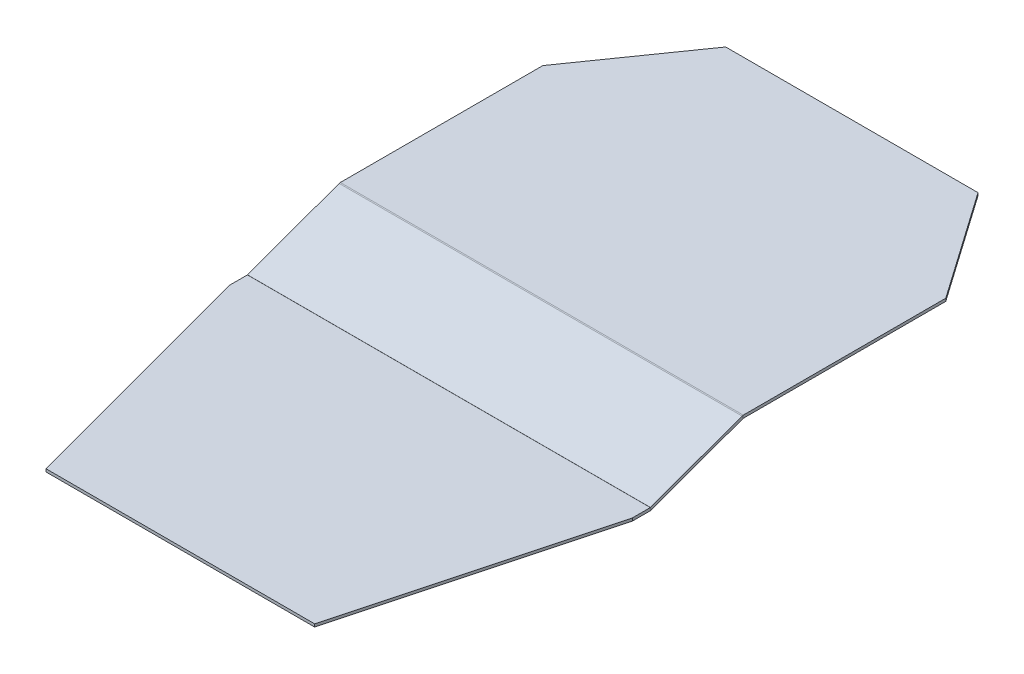
ISO-10303-21;
HEADER;
FILE_DESCRIPTION(('STEP AP214'),'2;1');
FILE_NAME('part.step','',(''),(''),'','','');
FILE_SCHEMA(('AUTOMOTIVE_DESIGN { 1 0 10303 214 1 1 1 1 }'));
ENDSEC;
DATA;
#1=APPLICATION_CONTEXT('core data for automotive mechanical design processes');
#2=APPLICATION_PROTOCOL_DEFINITION('international standard','automotive_design',2000,#1);
#3=PRODUCT_CONTEXT('',#1,'mechanical');
#4=PRODUCT('Part','Part','',(#3));
#5=PRODUCT_RELATED_PRODUCT_CATEGORY('part','',(#4));
#6=PRODUCT_DEFINITION_FORMATION('','',#4);
#7=PRODUCT_DEFINITION_CONTEXT('part definition',#1,'design');
#8=PRODUCT_DEFINITION('design','',#6,#7);
#9=PRODUCT_DEFINITION_SHAPE('','',#8);
#10=(LENGTH_UNIT() NAMED_UNIT(*) SI_UNIT(.MILLI.,.METRE.));
#11=(NAMED_UNIT(*) PLANE_ANGLE_UNIT() SI_UNIT($,.RADIAN.));
#12=(NAMED_UNIT(*) SI_UNIT($,.STERADIAN.) SOLID_ANGLE_UNIT());
#13=UNCERTAINTY_MEASURE_WITH_UNIT(LENGTH_MEASURE(1.E-05),#10,'distance_accuracy_value','');
#14=(GEOMETRIC_REPRESENTATION_CONTEXT(3) GLOBAL_UNCERTAINTY_ASSIGNED_CONTEXT((#13)) GLOBAL_UNIT_ASSIGNED_CONTEXT((#10,
#11,#12)) REPRESENTATION_CONTEXT('',''));
#15=CARTESIAN_POINT('',(0.,0.,0.));
#16=DIRECTION('',(0.,0.,1.));
#17=DIRECTION('',(1.,0.,0.));
#18=AXIS2_PLACEMENT_3D('',#15,#16,#17);
#19=CARTESIAN_POINT('',(457.2,0.0444224155289619,-0.122049583583453));
#20=DIRECTION('',(1.,0.,0.));
#21=DIRECTION('',(0.,0.,-1.));
#22=AXIS2_PLACEMENT_3D('',#19,#20,#21);
#23=PLANE('',#22);
#24=DIRECTION('',(0.,-0.939692620785908,-0.342020143325669));
#25=VECTOR('',#24,1.);
#26=CARTESIAN_POINT('',(457.2,0.0444224155289619,-0.122049583583453));
#27=LINE('',#26,#25);
#28=CARTESIAN_POINT('',(457.2,0.0444224155289619,-0.122049583583453));
#29=VERTEX_POINT('',#28);
#30=CARTESIAN_POINT('',(457.2,-2.9391016554663,-1.20796353864245));
#31=VERTEX_POINT('',#30);
#32=EDGE_CURVE('E44',#29,#31,#27,.T.);
#33=ORIENTED_EDGE('',*,*,#32,.F.);
#34=CARTESIAN_POINT('',(457.2,0.736599999999936,0.129882453990262));
#35=DIRECTION('',(-1.,0.,0.));
#36=DIRECTION('',(0.,0.,1.));
#37=AXIS2_PLACEMENT_3D('',#34,#35,#36);
#38=CIRCLE('',#37,0.7366);
#39=CARTESIAN_POINT('',(457.2,0.,0.129882453990482));
#40=VERTEX_POINT('',#39);
#41=EDGE_CURVE('E299',#40,#29,#38,.F.);
#42=ORIENTED_EDGE('',*,*,#41,.F.);
#43=DIRECTION('',(0.,1.,-2.9869343000726E-13));
#44=VECTOR('',#43,1.);
#45=CARTESIAN_POINT('',(457.2,-3.17500000000006,0.12988245399143));
#46=LINE('',#45,#44);
#47=CARTESIAN_POINT('',(457.2,-3.17500000000006,0.12988245399143));
#48=VERTEX_POINT('',#47);
#49=EDGE_CURVE('E192',#48,#40,#46,.T.);
#50=ORIENTED_EDGE('',*,*,#49,.F.);
#51=CARTESIAN_POINT('',(457.2,0.736599999999936,0.129882453990262));
#52=DIRECTION('',(1.,0.,0.));
#53=DIRECTION('',(0.,0.,-1.));
#54=AXIS2_PLACEMENT_3D('',#51,#52,#53);
#55=CIRCLE('',#54,3.9116);
#56=EDGE_CURVE('E210',#48,#31,#55,.T.);
#57=ORIENTED_EDGE('',*,*,#56,.T.);
#58=EDGE_LOOP('',(#33,#42,#50,#57));
#59=FACE_BOUND('',#58,.T.);
#60=ADVANCED_FACE('F37',(#59),#23,.T.);
#61=CARTESIAN_POINT('',(457.2,-3.17500000000006,0.12988245399143));
#62=DIRECTION('',(1.,0.,0.));
#63=DIRECTION('',(0.,0.,-1.));
#64=AXIS2_PLACEMENT_3D('',#61,#62,#63);
#65=PLANE('',#64);
#66=DIRECTION('',(0.,0.342020143325669,-0.939692620785908));
#67=VECTOR('',#66,1.);
#68=CARTESIAN_POINT('',(457.2,0.,0.));
#69=LINE('',#68,#67);
#70=CARTESIAN_POINT('',(457.2,37.8641016554662,-104.030764306328));
#71=VERTEX_POINT('',#70);
#72=EDGE_CURVE('E203',#29,#71,#69,.T.);
#73=ORIENTED_EDGE('',*,*,#72,.F.);
#74=ORIENTED_EDGE('',*,*,#32,.T.);
#75=DIRECTION('',(0.,0.342020143325669,-0.939692620785908));
#76=VECTOR('',#75,1.);
#77=CARTESIAN_POINT('',(457.2,-2.98352407099526,-1.085913955059));
#78=LINE('',#77,#76);
#79=CARTESIAN_POINT('',(457.2,34.8805775844709,-105.116678261387));
#80=VERTEX_POINT('',#79);
#81=EDGE_CURVE('E200',#31,#80,#78,.T.);
#82=ORIENTED_EDGE('',*,*,#81,.T.);
#83=DIRECTION('',(0.,0.939692620785913,0.342020143325657));
#84=VECTOR('',#83,1.);
#85=CARTESIAN_POINT('',(457.2,34.8805775844709,-105.116678261387));
#86=LINE('',#85,#84);
#87=EDGE_CURVE('E183',#80,#71,#86,.T.);
#88=ORIENTED_EDGE('',*,*,#87,.T.);
#89=EDGE_LOOP('',(#73,#74,#82,#88));
#90=FACE_BOUND('',#89,.T.);
#91=ADVANCED_FACE('F198',(#90),#65,.T.);
#92=CARTESIAN_POINT('',(0.,0.,0.129882453990482));
#93=DIRECTION('',(-1.,0.,0.));
#94=DIRECTION('',(0.,0.,1.));
#95=AXIS2_PLACEMENT_3D('',#92,#93,#94);
#96=PLANE('',#95);
#97=DIRECTION('',(0.,-1.,2.9869343000726E-13));
#98=VECTOR('',#97,1.);
#99=CARTESIAN_POINT('',(0.,0.,0.129882453990482));
#100=LINE('',#99,#98);
#101=CARTESIAN_POINT('',(0.,0.,0.129882453990482));
#102=VERTEX_POINT('',#101);
#103=CARTESIAN_POINT('',(0.,-3.17500000000006,0.12988245399143));
#104=VERTEX_POINT('',#103);
#105=EDGE_CURVE('E189',#102,#104,#100,.T.);
#106=ORIENTED_EDGE('',*,*,#105,.F.);
#107=CARTESIAN_POINT('',(0.,0.736599999999936,0.129882453990262));
#108=DIRECTION('',(-1.,0.,0.));
#109=DIRECTION('',(0.,0.,1.));
#110=AXIS2_PLACEMENT_3D('',#107,#108,#109);
#111=CIRCLE('',#110,0.7366);
#112=CARTESIAN_POINT('',(0.,0.0444224155289619,-0.122049583583453));
#113=VERTEX_POINT('',#112);
#114=EDGE_CURVE('E251',#102,#113,#111,.F.);
#115=ORIENTED_EDGE('',*,*,#114,.T.);
#116=DIRECTION('',(0.,0.939692620785908,0.342020143325669));
#117=VECTOR('',#116,1.);
#118=CARTESIAN_POINT('',(0.,-2.9391016554663,-1.20796353864245));
#119=LINE('',#118,#117);
#120=CARTESIAN_POINT('',(0.,-2.9391016554663,-1.20796353864245));
#121=VERTEX_POINT('',#120);
#122=EDGE_CURVE('E187',#121,#113,#119,.T.);
#123=ORIENTED_EDGE('',*,*,#122,.F.);
#124=CARTESIAN_POINT('',(0.,0.736599999999936,0.129882453990262));
#125=DIRECTION('',(1.,0.,0.));
#126=DIRECTION('',(0.,0.,-1.));
#127=AXIS2_PLACEMENT_3D('',#124,#125,#126);
#128=CIRCLE('',#127,3.9116);
#129=EDGE_CURVE('E222',#104,#121,#128,.T.);
#130=ORIENTED_EDGE('',*,*,#129,.F.);
#131=EDGE_LOOP('',(#106,#115,#123,#130));
#132=FACE_BOUND('',#131,.T.);
#133=ADVANCED_FACE('F319',(#132),#96,.T.);
#134=CARTESIAN_POINT('',(0.,-2.9391016554663,-1.20796353864245));
#135=DIRECTION('',(-1.,0.,0.));
#136=DIRECTION('',(0.,0.,1.));
#137=AXIS2_PLACEMENT_3D('',#134,#135,#136);
#138=PLANE('',#137);
#139=DIRECTION('',(0.,1.,0.));
#140=VECTOR('',#139,1.);
#141=CARTESIAN_POINT('',(0.,-3.17500000000006,20.4177284632565));
#142=LINE('',#141,#140);
#143=CARTESIAN_POINT('',(0.,-3.175,20.4177284632566));
#144=VERTEX_POINT('',#143);
#145=CARTESIAN_POINT('',(0.,0.,20.4177284632565));
#146=VERTEX_POINT('',#145);
#147=EDGE_CURVE('E59',#144,#146,#142,.T.);
#148=ORIENTED_EDGE('',*,*,#147,.T.);
#149=DIRECTION('',(0.,0.,-1.));
#150=VECTOR('',#149,1.);
#151=CARTESIAN_POINT('',(0.,0.,304.8));
#152=LINE('',#151,#150);
#153=EDGE_CURVE('E254',#146,#102,#152,.T.);
#154=ORIENTED_EDGE('',*,*,#153,.T.);
#155=ORIENTED_EDGE('',*,*,#105,.T.);
#156=DIRECTION('',(0.,0.,-1.));
#157=VECTOR('',#156,1.);
#158=CARTESIAN_POINT('',(0.,-3.175,304.8));
#159=LINE('',#158,#157);
#160=EDGE_CURVE('E256',#144,#104,#159,.T.);
#161=ORIENTED_EDGE('',*,*,#160,.F.);
#162=EDGE_LOOP('',(#148,#154,#155,#161));
#163=FACE_BOUND('',#162,.T.);
#164=ADVANCED_FACE('F383',(#163),#138,.T.);
#165=CARTESIAN_POINT('',(457.2,38.1,-105.36861029896));
#166=DIRECTION('',(1.,0.,0.));
#167=DIRECTION('',(0.,0.,-1.));
#168=AXIS2_PLACEMENT_3D('',#165,#166,#167);
#169=PLANE('',#168);
#170=DIRECTION('',(0.,-1.,0.));
#171=VECTOR('',#170,1.);
#172=CARTESIAN_POINT('',(457.2,38.1,-105.36861029896));
#173=LINE('',#172,#171);
#174=CARTESIAN_POINT('',(457.2,38.1,-105.36861029896));
#175=VERTEX_POINT('',#174);
#176=CARTESIAN_POINT('',(457.2,34.925,-105.36861029896));
#177=VERTEX_POINT('',#176);
#178=EDGE_CURVE('E185',#175,#177,#173,.T.);
#179=ORIENTED_EDGE('',*,*,#178,.F.);
#180=CARTESIAN_POINT('',(457.2,34.1884,-105.36861029896));
#181=DIRECTION('',(1.,0.,0.));
#182=DIRECTION('',(0.,0.,-1.));
#183=AXIS2_PLACEMENT_3D('',#180,#181,#182);
#184=CIRCLE('',#183,3.9116);
#185=EDGE_CURVE('E303',#71,#175,#184,.F.);
#186=ORIENTED_EDGE('',*,*,#185,.F.);
#187=ORIENTED_EDGE('',*,*,#87,.F.);
#188=CARTESIAN_POINT('',(457.2,34.1884,-105.36861029896));
#189=DIRECTION('',(1.,0.,0.));
#190=DIRECTION('',(0.,0.,-1.));
#191=AXIS2_PLACEMENT_3D('',#188,#189,#190);
#192=CIRCLE('',#191,0.7366);
#193=EDGE_CURVE('E232',#80,#177,#192,.F.);
#194=ORIENTED_EDGE('',*,*,#193,.T.);
#195=EDGE_LOOP('',(#179,#186,#187,#194));
#196=FACE_BOUND('',#195,.T.);
#197=ADVANCED_FACE('F343',(#196),#169,.T.);
#198=CARTESIAN_POINT('',(457.2,34.8805775844709,-105.116678261387));
#199=DIRECTION('',(1.,0.,0.));
#200=DIRECTION('',(0.,0.,-1.));
#201=AXIS2_PLACEMENT_3D('',#198,#199,#200);
#202=PLANE('',#201);
#203=DIRECTION('',(0.,1.,0.));
#204=VECTOR('',#203,1.);
#205=CARTESIAN_POINT('',(457.2,-3.17500000000006,-335.182271536743));
#206=LINE('',#205,#204);
#207=CARTESIAN_POINT('',(457.2,34.925,-335.182271536743));
#208=VERTEX_POINT('',#207);
#209=CARTESIAN_POINT('',(457.2,38.1,-335.182271536743));
#210=VERTEX_POINT('',#209);
#211=EDGE_CURVE('E157',#208,#210,#206,.T.);
#212=ORIENTED_EDGE('',*,*,#211,.T.);
#213=DIRECTION('',(0.,0.,-1.));
#214=VECTOR('',#213,1.);
#215=CARTESIAN_POINT('',(457.2,38.1,-104.678889681221));
#216=LINE('',#215,#214);
#217=EDGE_CURVE('E341',#175,#210,#216,.T.);
#218=ORIENTED_EDGE('',*,*,#217,.F.);
#219=ORIENTED_EDGE('',*,*,#178,.T.);
#220=DIRECTION('',(0.,0.,-1.));
#221=VECTOR('',#220,1.);
#222=CARTESIAN_POINT('',(457.2,34.925,-104.678889681221));
#223=LINE('',#222,#221);
#224=EDGE_CURVE('E264',#177,#208,#223,.T.);
#225=ORIENTED_EDGE('',*,*,#224,.T.);
#226=EDGE_LOOP('',(#212,#218,#219,#225));
#227=FACE_BOUND('',#226,.T.);
#228=ADVANCED_FACE('F348',(#227),#202,.T.);
#229=CARTESIAN_POINT('',(0.,37.8641016554662,-104.030764306328));
#230=DIRECTION('',(-1.,0.,0.));
#231=DIRECTION('',(0.,0.,1.));
#232=AXIS2_PLACEMENT_3D('',#229,#230,#231);
#233=PLANE('',#232);
#234=DIRECTION('',(0.,-0.939692620785913,-0.342020143325657));
#235=VECTOR('',#234,1.);
#236=CARTESIAN_POINT('',(0.,37.8641016554662,-104.030764306328));
#237=LINE('',#236,#235);
#238=CARTESIAN_POINT('',(0.,37.8641016554662,-104.030764306328));
#239=VERTEX_POINT('',#238);
#240=CARTESIAN_POINT('',(0.,34.8805775844709,-105.116678261387));
#241=VERTEX_POINT('',#240);
#242=EDGE_CURVE('E181',#239,#241,#237,.T.);
#243=ORIENTED_EDGE('',*,*,#242,.F.);
#244=CARTESIAN_POINT('',(0.,34.1884,-105.36861029896));
#245=DIRECTION('',(1.,0.,0.));
#246=DIRECTION('',(0.,0.,-1.));
#247=AXIS2_PLACEMENT_3D('',#244,#245,#246);
#248=CIRCLE('',#247,3.9116);
#249=CARTESIAN_POINT('',(0.,38.1,-105.36861029896));
#250=VERTEX_POINT('',#249);
#251=EDGE_CURVE('E245',#239,#250,#248,.F.);
#252=ORIENTED_EDGE('',*,*,#251,.T.);
#253=DIRECTION('',(0.,1.,0.));
#254=VECTOR('',#253,1.);
#255=CARTESIAN_POINT('',(0.,34.925,-105.36861029896));
#256=LINE('',#255,#254);
#257=CARTESIAN_POINT('',(0.,34.925,-105.36861029896));
#258=VERTEX_POINT('',#257);
#259=EDGE_CURVE('E173',#258,#250,#256,.T.);
#260=ORIENTED_EDGE('',*,*,#259,.F.);
#261=CARTESIAN_POINT('',(0.,34.1884,-105.36861029896));
#262=DIRECTION('',(1.,0.,0.));
#263=DIRECTION('',(0.,0.,-1.));
#264=AXIS2_PLACEMENT_3D('',#261,#262,#263);
#265=CIRCLE('',#264,0.7366);
#266=EDGE_CURVE('E261',#241,#258,#265,.F.);
#267=ORIENTED_EDGE('',*,*,#266,.F.);
#268=EDGE_LOOP('',(#243,#252,#260,#267));
#269=FACE_BOUND('',#268,.T.);
#270=ADVANCED_FACE('F392',(#269),#233,.T.);
#271=CARTESIAN_POINT('',(0.,34.925,-105.36861029896));
#272=DIRECTION('',(-1.,0.,0.));
#273=DIRECTION('',(0.,0.,1.));
#274=AXIS2_PLACEMENT_3D('',#271,#272,#273);
#275=PLANE('',#274);
#276=DIRECTION('',(0.,0.342020143325669,-0.939692620785908));
#277=VECTOR('',#276,1.);
#278=CARTESIAN_POINT('',(0.,0.,0.));
#279=LINE('',#278,#277);
#280=EDGE_CURVE('E248',#113,#239,#279,.T.);
#281=ORIENTED_EDGE('',*,*,#280,.T.);
#282=ORIENTED_EDGE('',*,*,#242,.T.);
#283=DIRECTION('',(0.,0.342020143325669,-0.939692620785908));
#284=VECTOR('',#283,1.);
#285=CARTESIAN_POINT('',(0.,-2.98352407099526,-1.085913955059));
#286=LINE('',#285,#284);
#287=EDGE_CURVE('E259',#121,#241,#286,.T.);
#288=ORIENTED_EDGE('',*,*,#287,.F.);
#289=ORIENTED_EDGE('',*,*,#122,.T.);
#290=EDGE_LOOP('',(#281,#282,#288,#289));
#291=FACE_BOUND('',#290,.T.);
#292=ADVANCED_FACE('F293',(#291),#275,.T.);
#293=CARTESIAN_POINT('',(457.2,34.925,-104.678889681221));
#294=DIRECTION('',(0.,1.,0.));
#295=DIRECTION('',(0.,0.,1.));
#296=AXIS2_PLACEMENT_3D('',#293,#294,#295);
#297=PLANE('',#296);
#298=DIRECTION('',(-1.,0.,0.));
#299=VECTOR('',#298,1.);
#300=CARTESIAN_POINT('',(457.2,34.925,-457.2));
#301=LINE('',#300,#299);
#302=CARTESIAN_POINT('',(371.762266734803,34.925,-457.2));
#303=VERTEX_POINT('',#302);
#304=CARTESIAN_POINT('',(85.4377332651967,34.925,-457.2));
#305=VERTEX_POINT('',#304);
#306=EDGE_CURVE('E165',#303,#305,#301,.T.);
#307=ORIENTED_EDGE('',*,*,#306,.F.);
#308=DIRECTION('',(0.573576436351042,0.,0.819152044288995));
#309=VECTOR('',#308,1.);
#310=CARTESIAN_POINT('',(565.501163497915,34.925,-180.512180759342));
#311=LINE('',#310,#309);
#312=EDGE_CURVE('E243',#303,#208,#311,.T.);
#313=ORIENTED_EDGE('',*,*,#312,.T.);
#314=ORIENTED_EDGE('',*,*,#224,.F.);
#315=DIRECTION('',(-1.,0.,0.));
#316=VECTOR('',#315,1.);
#317=CARTESIAN_POINT('',(457.2,34.925,-105.36861029896));
#318=LINE('',#317,#316);
#319=EDGE_CURVE('E235',#177,#258,#318,.T.);
#320=ORIENTED_EDGE('',*,*,#319,.T.);
#321=DIRECTION('',(0.,0.,-1.));
#322=VECTOR('',#321,1.);
#323=CARTESIAN_POINT('',(0.,34.925,-104.678889681221));
#324=LINE('',#323,#322);
#325=CARTESIAN_POINT('',(0.,34.925,-335.182271536743));
#326=VERTEX_POINT('',#325);
#327=EDGE_CURVE('E239',#258,#326,#324,.T.);
#328=ORIENTED_EDGE('',*,*,#327,.T.);
#329=DIRECTION('',(0.573576436351041,0.,-0.819152044288995));
#330=VECTOR('',#329,1.);
#331=CARTESIAN_POINT('',(42.1130317378346,34.925,-395.325913871));
#332=LINE('',#331,#330);
#333=EDGE_CURVE('E331',#326,#305,#332,.T.);
#334=ORIENTED_EDGE('',*,*,#333,.T.);
#335=EDGE_LOOP('',(#307,#313,#314,#320,#328,#334));
#336=FACE_BOUND('',#335,.T.);
#337=ADVANCED_FACE('F397',(#336),#297,.F.);
#338=CARTESIAN_POINT('',(457.2,38.1,-457.2));
#339=DIRECTION('',(0.,0.,-1.));
#340=DIRECTION('',(-1.,0.,0.));
#341=AXIS2_PLACEMENT_3D('',#338,#339,#340);
#342=PLANE('',#341);
#343=DIRECTION('',(0.,1.,0.));
#344=VECTOR('',#343,1.);
#345=CARTESIAN_POINT('',(371.762266734803,-3.17500000000006,-457.2));
#346=LINE('',#345,#344);
#347=CARTESIAN_POINT('',(371.762266734803,38.1,-457.2));
#348=VERTEX_POINT('',#347);
#349=EDGE_CURVE('E51',#303,#348,#346,.T.);
#350=ORIENTED_EDGE('',*,*,#349,.F.);
#351=ORIENTED_EDGE('',*,*,#306,.T.);
#352=DIRECTION('',(0.,1.,0.));
#353=VECTOR('',#352,1.);
#354=CARTESIAN_POINT('',(85.4377332651967,-3.17500000000006,-457.2));
#355=LINE('',#354,#353);
#356=CARTESIAN_POINT('',(85.4377332651967,38.1,-457.2));
#357=VERTEX_POINT('',#356);
#358=EDGE_CURVE('E151',#305,#357,#355,.T.);
#359=ORIENTED_EDGE('',*,*,#358,.T.);
#360=DIRECTION('',(-1.,0.,0.));
#361=VECTOR('',#360,1.);
#362=CARTESIAN_POINT('',(457.2,38.1,-457.2));
#363=LINE('',#362,#361);
#364=EDGE_CURVE('E163',#348,#357,#363,.T.);
#365=ORIENTED_EDGE('',*,*,#364,.F.);
#366=EDGE_LOOP('',(#350,#351,#359,#365));
#367=FACE_BOUND('',#366,.T.);
#368=ADVANCED_FACE('F162',(#367),#342,.T.);
#369=CARTESIAN_POINT('',(457.2,38.1,-104.678889681221));
#370=DIRECTION('',(0.,1.,0.));
#371=DIRECTION('',(0.,0.,1.));
#372=AXIS2_PLACEMENT_3D('',#369,#370,#371);
#373=PLANE('',#372);
#374=DIRECTION('',(0.573576436351041,0.,0.819152044288995));
#375=VECTOR('',#374,1.);
#376=CARTESIAN_POINT('',(371.762266734803,38.1,-457.2));
#377=LINE('',#376,#375);
#378=EDGE_CURVE('E170',#348,#210,#377,.T.);
#379=ORIENTED_EDGE('',*,*,#378,.F.);
#380=ORIENTED_EDGE('',*,*,#364,.T.);
#381=DIRECTION('',(0.573576436351041,0.,-0.819152044288995));
#382=VECTOR('',#381,1.);
#383=CARTESIAN_POINT('',(85.4377332651967,38.1,-457.2));
#384=LINE('',#383,#382);
#385=CARTESIAN_POINT('',(0.,38.1,-335.182271536743));
#386=VERTEX_POINT('',#385);
#387=EDGE_CURVE('E148',#386,#357,#384,.T.);
#388=ORIENTED_EDGE('',*,*,#387,.F.);
#389=DIRECTION('',(0.,0.,-1.));
#390=VECTOR('',#389,1.);
#391=CARTESIAN_POINT('',(0.,38.1,-104.678889681221));
#392=LINE('',#391,#390);
#393=EDGE_CURVE('E242',#250,#386,#392,.T.);
#394=ORIENTED_EDGE('',*,*,#393,.F.);
#395=DIRECTION('',(-1.,0.,0.));
#396=VECTOR('',#395,1.);
#397=CARTESIAN_POINT('',(457.2,38.1,-105.36861029896));
#398=LINE('',#397,#396);
#399=EDGE_CURVE('E171',#175,#250,#398,.T.);
#400=ORIENTED_EDGE('',*,*,#399,.F.);
#401=ORIENTED_EDGE('',*,*,#217,.T.);
#402=EDGE_LOOP('',(#379,#380,#388,#394,#400,#401));
#403=FACE_BOUND('',#402,.T.);
#404=ADVANCED_FACE('F168',(#403),#373,.T.);
#405=CARTESIAN_POINT('',(457.2,34.1884,-105.36861029896));
#406=DIRECTION('',(-1.,0.,0.));
#407=DIRECTION('',(0.,0.,1.));
#408=AXIS2_PLACEMENT_3D('',#405,#406,#407);
#409=CYLINDRICAL_SURFACE('',#408,3.9116);
#410=ORIENTED_EDGE('',*,*,#251,.F.);
#411=DIRECTION('',(-1.,0.,0.));
#412=VECTOR('',#411,1.);
#413=CARTESIAN_POINT('',(457.2,37.8641016554662,-104.030764306328));
#414=LINE('',#413,#412);
#415=EDGE_CURVE('E176',#71,#239,#414,.T.);
#416=ORIENTED_EDGE('',*,*,#415,.F.);
#417=ORIENTED_EDGE('',*,*,#185,.T.);
#418=ORIENTED_EDGE('',*,*,#399,.T.);
#419=EDGE_LOOP('',(#410,#416,#417,#418));
#420=FACE_BOUND('',#419,.T.);
#421=ADVANCED_FACE('F289',(#420),#409,.T.);
#422=CARTESIAN_POINT('',(457.2,0.,0.));
#423=DIRECTION('',(0.,0.939692620785908,0.342020143325669));
#424=DIRECTION('',(0.,-0.342020143325669,0.939692620785908));
#425=AXIS2_PLACEMENT_3D('',#422,#423,#424);
#426=PLANE('',#425);
#427=ORIENTED_EDGE('',*,*,#280,.F.);
#428=DIRECTION('',(-1.,0.,0.));
#429=VECTOR('',#428,1.);
#430=CARTESIAN_POINT('',(457.2,0.0444224155289619,-0.122049583583453));
#431=LINE('',#430,#429);
#432=EDGE_CURVE('E278',#29,#113,#431,.T.);
#433=ORIENTED_EDGE('',*,*,#432,.F.);
#434=ORIENTED_EDGE('',*,*,#72,.T.);
#435=ORIENTED_EDGE('',*,*,#415,.T.);
#436=EDGE_LOOP('',(#427,#433,#434,#435));
#437=FACE_BOUND('',#436,.T.);
#438=ADVANCED_FACE('F285',(#437),#426,.T.);
#439=CARTESIAN_POINT('',(457.2,0.736599999999936,0.129882453990262));
#440=DIRECTION('',(-1.,0.,0.));
#441=DIRECTION('',(0.,0.,1.));
#442=AXIS2_PLACEMENT_3D('',#439,#440,#441);
#443=CYLINDRICAL_SURFACE('',#442,0.7366);
#444=ORIENTED_EDGE('',*,*,#114,.F.);
#445=DIRECTION('',(-1.,0.,0.));
#446=VECTOR('',#445,1.);
#447=CARTESIAN_POINT('',(457.2,0.,0.129882453990482));
#448=LINE('',#447,#446);
#449=EDGE_CURVE('E275',#40,#102,#448,.T.);
#450=ORIENTED_EDGE('',*,*,#449,.F.);
#451=ORIENTED_EDGE('',*,*,#41,.T.);
#452=ORIENTED_EDGE('',*,*,#432,.T.);
#453=EDGE_LOOP('',(#444,#450,#451,#452));
#454=FACE_BOUND('',#453,.T.);
#455=ADVANCED_FACE('F297',(#454),#443,.F.);
#456=CARTESIAN_POINT('',(457.2,0.,304.8));
#457=DIRECTION('',(0.,1.,0.));
#458=DIRECTION('',(0.,0.,1.));
#459=AXIS2_PLACEMENT_3D('',#456,#457,#458);
#460=PLANE('',#459);
#461=DIRECTION('',(-0.258819045102525,0.,0.965925826289067));
#462=VECTOR('',#461,1.);
#463=CARTESIAN_POINT('',(386.104432115813,0.,285.75));
#464=LINE('',#463,#462);
#465=CARTESIAN_POINT('',(457.2,0.,20.4177284632565));
#466=VERTEX_POINT('',#465);
#467=CARTESIAN_POINT('',(381.,0.,304.8));
#468=VERTEX_POINT('',#467);
#469=EDGE_CURVE('E327',#466,#468,#464,.T.);
#470=ORIENTED_EDGE('',*,*,#469,.F.);
#471=DIRECTION('',(0.,0.,-1.));
#472=VECTOR('',#471,1.);
#473=CARTESIAN_POINT('',(457.2,0.,304.8));
#474=LINE('',#473,#472);
#475=EDGE_CURVE('E300',#466,#40,#474,.T.);
#476=ORIENTED_EDGE('',*,*,#475,.T.);
#477=ORIENTED_EDGE('',*,*,#449,.T.);
#478=ORIENTED_EDGE('',*,*,#153,.F.);
#479=DIRECTION('',(-0.258819045102525,0.,-0.965925826289067));
#480=VECTOR('',#479,1.);
#481=CARTESIAN_POINT('',(101.722160579065,0.,400.050000000001));
#482=LINE('',#481,#480);
#483=CARTESIAN_POINT('',(76.2,0.,304.8));
#484=VERTEX_POINT('',#483);
#485=EDGE_CURVE('E330',#484,#146,#482,.T.);
#486=ORIENTED_EDGE('',*,*,#485,.F.);
#487=DIRECTION('',(-1.,0.,0.));
#488=VECTOR('',#487,1.);
#489=CARTESIAN_POINT('',(457.2,0.,304.8));
#490=LINE('',#489,#488);
#491=EDGE_CURVE('E272',#468,#484,#490,.T.);
#492=ORIENTED_EDGE('',*,*,#491,.F.);
#493=EDGE_LOOP('',(#470,#476,#477,#478,#486,#492));
#494=FACE_BOUND('',#493,.T.);
#495=ADVANCED_FACE('F324',(#494),#460,.T.);
#496=CARTESIAN_POINT('',(457.2,-3.175,304.8));
#497=DIRECTION('',(0.,0.,1.));
#498=DIRECTION('',(1.,0.,0.));
#499=AXIS2_PLACEMENT_3D('',#496,#497,#498);
#500=PLANE('',#499);
#501=DIRECTION('',(0.,1.,0.));
#502=VECTOR('',#501,1.);
#503=CARTESIAN_POINT('',(381.,-3.17500000000006,304.8));
#504=LINE('',#503,#502);
#505=CARTESIAN_POINT('',(381.,-3.17500000000006,304.8));
#506=VERTEX_POINT('',#505);
#507=EDGE_CURVE('E355',#506,#468,#504,.T.);
#508=ORIENTED_EDGE('',*,*,#507,.T.);
#509=ORIENTED_EDGE('',*,*,#491,.T.);
#510=DIRECTION('',(0.,1.,0.));
#511=VECTOR('',#510,1.);
#512=CARTESIAN_POINT('',(76.2,-3.17500000000006,304.8));
#513=LINE('',#512,#511);
#514=CARTESIAN_POINT('',(76.2,-3.17500000000006,304.8));
#515=VERTEX_POINT('',#514);
#516=EDGE_CURVE('E359',#515,#484,#513,.T.);
#517=ORIENTED_EDGE('',*,*,#516,.F.);
#518=DIRECTION('',(-1.,0.,0.));
#519=VECTOR('',#518,1.);
#520=CARTESIAN_POINT('',(457.2,-3.175,304.8));
#521=LINE('',#520,#519);
#522=EDGE_CURVE('E269',#506,#515,#521,.T.);
#523=ORIENTED_EDGE('',*,*,#522,.F.);
#524=EDGE_LOOP('',(#508,#509,#517,#523));
#525=FACE_BOUND('',#524,.T.);
#526=ADVANCED_FACE('F363',(#525),#500,.T.);
#527=CARTESIAN_POINT('',(457.2,-3.175,304.8));
#528=DIRECTION('',(0.,1.,0.));
#529=DIRECTION('',(0.,0.,1.));
#530=AXIS2_PLACEMENT_3D('',#527,#528,#529);
#531=PLANE('',#530);
#532=DIRECTION('',(0.,0.,-1.));
#533=VECTOR('',#532,1.);
#534=CARTESIAN_POINT('',(457.2,-3.175,304.8));
#535=LINE('',#534,#533);
#536=CARTESIAN_POINT('',(457.2,-3.175,20.4177284632565));
#537=VERTEX_POINT('',#536);
#538=EDGE_CURVE('E215',#537,#48,#535,.T.);
#539=ORIENTED_EDGE('',*,*,#538,.F.);
#540=DIRECTION('',(-0.258819045102525,0.,0.965925826289067));
#541=VECTOR('',#540,1.);
#542=CARTESIAN_POINT('',(381.,-3.17500000000006,304.8));
#543=LINE('',#542,#541);
#544=EDGE_CURVE('E315',#537,#506,#543,.T.);
#545=ORIENTED_EDGE('',*,*,#544,.T.);
#546=ORIENTED_EDGE('',*,*,#522,.T.);
#547=DIRECTION('',(-0.258819045102525,0.,-0.965925826289067));
#548=VECTOR('',#547,1.);
#549=CARTESIAN_POINT('',(76.2,-3.17500000000006,304.8));
#550=LINE('',#549,#548);
#551=EDGE_CURVE('E166',#515,#144,#550,.T.);
#552=ORIENTED_EDGE('',*,*,#551,.T.);
#553=ORIENTED_EDGE('',*,*,#160,.T.);
#554=DIRECTION('',(-1.,0.,0.));
#555=VECTOR('',#554,1.);
#556=CARTESIAN_POINT('',(457.2,-3.17500000000006,0.12988245399143));
#557=LINE('',#556,#555);
#558=EDGE_CURVE('E226',#48,#104,#557,.T.);
#559=ORIENTED_EDGE('',*,*,#558,.F.);
#560=EDGE_LOOP('',(#539,#545,#546,#552,#553,#559));
#561=FACE_BOUND('',#560,.T.);
#562=ADVANCED_FACE('F314',(#561),#531,.F.);
#563=CARTESIAN_POINT('',(457.2,0.736599999999936,0.129882453990262));
#564=DIRECTION('',(-1.,0.,0.));
#565=DIRECTION('',(0.,0.,1.));
#566=AXIS2_PLACEMENT_3D('',#563,#564,#565);
#567=CYLINDRICAL_SURFACE('',#566,3.9116);
#568=ORIENTED_EDGE('',*,*,#129,.T.);
#569=DIRECTION('',(-1.,0.,0.));
#570=VECTOR('',#569,1.);
#571=CARTESIAN_POINT('',(457.2,-2.9391016554663,-1.20796353864245));
#572=LINE('',#571,#570);
#573=EDGE_CURVE('E219',#31,#121,#572,.T.);
#574=ORIENTED_EDGE('',*,*,#573,.F.);
#575=ORIENTED_EDGE('',*,*,#56,.F.);
#576=ORIENTED_EDGE('',*,*,#558,.T.);
#577=EDGE_LOOP('',(#568,#574,#575,#576));
#578=FACE_BOUND('',#577,.T.);
#579=ADVANCED_FACE('F220',(#578),#567,.T.);
#580=CARTESIAN_POINT('',(457.2,-2.98352407099526,-1.085913955059));
#581=DIRECTION('',(0.,0.939692620785908,0.34202014332567));
#582=DIRECTION('',(0.,-0.34202014332567,0.939692620785908));
#583=AXIS2_PLACEMENT_3D('',#580,#581,#582);
#584=PLANE('',#583);
#585=ORIENTED_EDGE('',*,*,#287,.T.);
#586=DIRECTION('',(-1.,0.,0.));
#587=VECTOR('',#586,1.);
#588=CARTESIAN_POINT('',(457.2,34.8805775844709,-105.116678261387));
#589=LINE('',#588,#587);
#590=EDGE_CURVE('E227',#80,#241,#589,.T.);
#591=ORIENTED_EDGE('',*,*,#590,.F.);
#592=ORIENTED_EDGE('',*,*,#81,.F.);
#593=ORIENTED_EDGE('',*,*,#573,.T.);
#594=EDGE_LOOP('',(#585,#591,#592,#593));
#595=FACE_BOUND('',#594,.T.);
#596=ADVANCED_FACE('F229',(#595),#584,.F.);
#597=CARTESIAN_POINT('',(457.2,34.1884,-105.36861029896));
#598=DIRECTION('',(-1.,0.,0.));
#599=DIRECTION('',(0.,0.,1.));
#600=AXIS2_PLACEMENT_3D('',#597,#598,#599);
#601=CYLINDRICAL_SURFACE('',#600,0.7366);
#602=ORIENTED_EDGE('',*,*,#266,.T.);
#603=ORIENTED_EDGE('',*,*,#319,.F.);
#604=ORIENTED_EDGE('',*,*,#193,.F.);
#605=ORIENTED_EDGE('',*,*,#590,.T.);
#606=EDGE_LOOP('',(#602,#603,#604,#605));
#607=FACE_BOUND('',#606,.T.);
#608=ADVANCED_FACE('F421',(#607),#601,.F.);
#609=CARTESIAN_POINT('',(457.2,34.1884,-105.36861029896));
#610=DIRECTION('',(1.,0.,0.));
#611=DIRECTION('',(0.,0.,-1.));
#612=AXIS2_PLACEMENT_3D('',#609,#610,#611);
#613=PLANE('',#612);
#614=DIRECTION('',(0.,1.,0.));
#615=VECTOR('',#614,1.);
#616=CARTESIAN_POINT('',(457.2,-3.17500000000006,20.4177284632565));
#617=LINE('',#616,#615);
#618=EDGE_CURVE('E311',#537,#466,#617,.T.);
#619=ORIENTED_EDGE('',*,*,#618,.F.);
#620=ORIENTED_EDGE('',*,*,#538,.T.);
#621=ORIENTED_EDGE('',*,*,#49,.T.);
#622=ORIENTED_EDGE('',*,*,#475,.F.);
#623=EDGE_LOOP('',(#619,#620,#621,#622));
#624=FACE_BOUND('',#623,.T.);
#625=ADVANCED_FACE('F309',(#624),#613,.T.);
#626=CARTESIAN_POINT('',(0.,34.1884,-105.36861029896));
#627=DIRECTION('',(1.,0.,0.));
#628=DIRECTION('',(0.,0.,-1.));
#629=AXIS2_PLACEMENT_3D('',#626,#627,#628);
#630=PLANE('',#629);
#631=ORIENTED_EDGE('',*,*,#393,.T.);
#632=DIRECTION('',(0.,-1.,0.));
#633=VECTOR('',#632,1.);
#634=CARTESIAN_POINT('',(0.,34.1884,-335.182271536743));
#635=LINE('',#634,#633);
#636=EDGE_CURVE('E11',#386,#326,#635,.T.);
#637=ORIENTED_EDGE('',*,*,#636,.T.);
#638=ORIENTED_EDGE('',*,*,#327,.F.);
#639=ORIENTED_EDGE('',*,*,#259,.T.);
#640=EDGE_LOOP('',(#631,#637,#638,#639));
#641=FACE_BOUND('',#640,.T.);
#642=ADVANCED_FACE('F373',(#641),#630,.F.);
#643=CARTESIAN_POINT('',(85.4377332651967,-3.17500000000006,-457.2));
#644=DIRECTION('',(0.819152044288995,0.,0.573576436351041));
#645=DIRECTION('',(0.573576436351041,0.,-0.819152044288995));
#646=AXIS2_PLACEMENT_3D('',#643,#644,#645);
#647=PLANE('',#646);
#648=ORIENTED_EDGE('',*,*,#636,.F.);
#649=ORIENTED_EDGE('',*,*,#387,.T.);
#650=ORIENTED_EDGE('',*,*,#358,.F.);
#651=ORIENTED_EDGE('',*,*,#333,.F.);
#652=EDGE_LOOP('',(#648,#649,#650,#651));
#653=FACE_BOUND('',#652,.T.);
#654=ADVANCED_FACE('F150',(#653),#647,.F.);
#655=CARTESIAN_POINT('',(381.,-3.17500000000006,304.8));
#656=DIRECTION('',(-0.965925826289067,0.,-0.258819045102525));
#657=DIRECTION('',(-0.258819045102525,0.,0.965925826289067));
#658=AXIS2_PLACEMENT_3D('',#655,#656,#657);
#659=PLANE('',#658);
#660=ORIENTED_EDGE('',*,*,#469,.T.);
#661=ORIENTED_EDGE('',*,*,#507,.F.);
#662=ORIENTED_EDGE('',*,*,#544,.F.);
#663=ORIENTED_EDGE('',*,*,#618,.T.);
#664=EDGE_LOOP('',(#660,#661,#662,#663));
#665=FACE_BOUND('',#664,.T.);
#666=ADVANCED_FACE('F364',(#665),#659,.F.);
#667=CARTESIAN_POINT('',(76.2,-3.17500000000006,304.8));
#668=DIRECTION('',(0.965925826289067,0.,-0.258819045102525));
#669=DIRECTION('',(-0.258819045102525,0.,-0.965925826289067));
#670=AXIS2_PLACEMENT_3D('',#667,#668,#669);
#671=PLANE('',#670);
#672=ORIENTED_EDGE('',*,*,#485,.T.);
#673=ORIENTED_EDGE('',*,*,#147,.F.);
#674=ORIENTED_EDGE('',*,*,#551,.F.);
#675=ORIENTED_EDGE('',*,*,#516,.T.);
#676=EDGE_LOOP('',(#672,#673,#674,#675));
#677=FACE_BOUND('',#676,.T.);
#678=ADVANCED_FACE('F361',(#677),#671,.F.);
#679=CARTESIAN_POINT('',(371.762266734803,-3.17500000000006,-457.2));
#680=DIRECTION('',(-0.819152044288995,0.,0.573576436351042));
#681=DIRECTION('',(0.573576436351042,0.,0.819152044288995));
#682=AXIS2_PLACEMENT_3D('',#679,#680,#681);
#683=PLANE('',#682);
#684=ORIENTED_EDGE('',*,*,#349,.T.);
#685=ORIENTED_EDGE('',*,*,#378,.T.);
#686=ORIENTED_EDGE('',*,*,#211,.F.);
#687=ORIENTED_EDGE('',*,*,#312,.F.);
#688=EDGE_LOOP('',(#684,#685,#686,#687));
#689=FACE_BOUND('',#688,.T.);
#690=ADVANCED_FACE('F371',(#689),#683,.F.);
#691=CLOSED_SHELL('',(#60,#91,#133,#164,#197,#228,#270,#292,#337,#368,#404,#421,#438,#455,#495,
#526,#562,#579,#596,#608,#625,#642,#654,#666,#678,#690));
#692=MANIFOLD_SOLID_BREP('B2',#691);
#693=ADVANCED_BREP_SHAPE_REPRESENTATION('',(#18,#692),#14);
#694=SHAPE_DEFINITION_REPRESENTATION(#9,#693);
ENDSEC;
END-ISO-10303-21;
